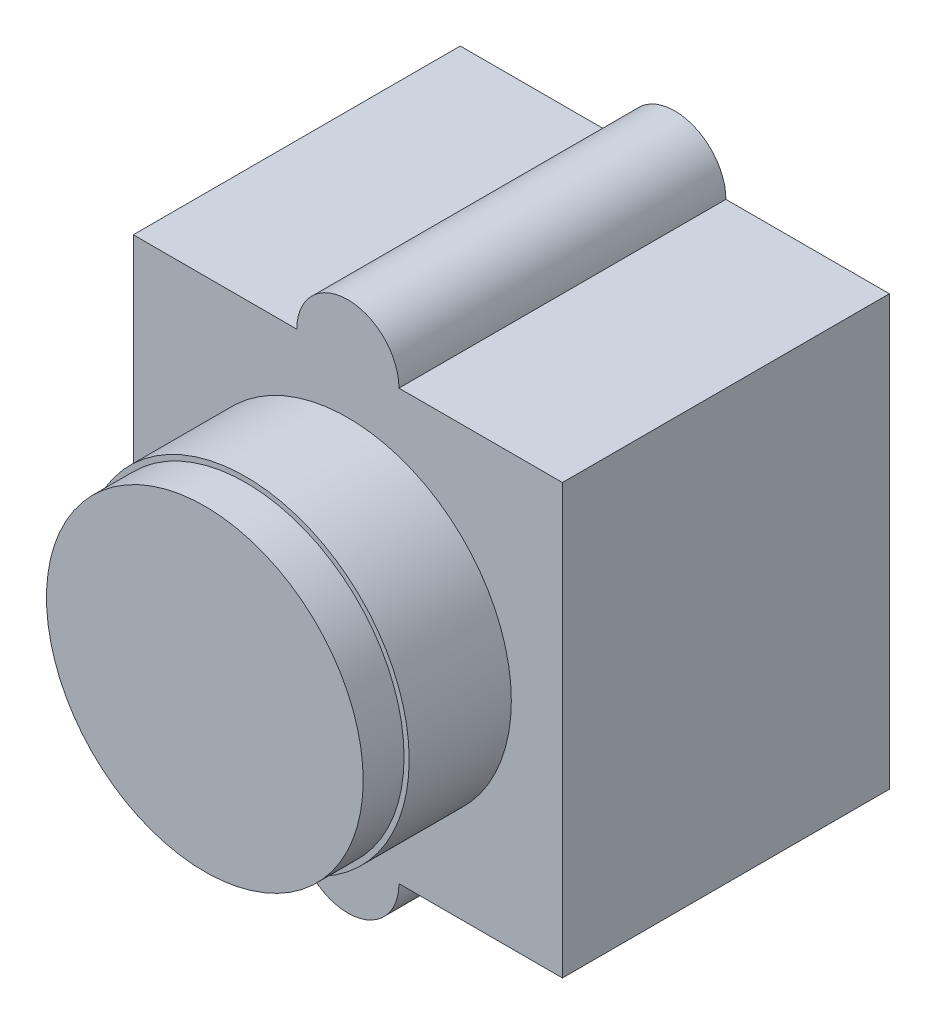
ISO-10303-21;
HEADER;
FILE_DESCRIPTION(('STEP AP214'),'2;1');
FILE_NAME('part.step','',(''),(''),'','','');
FILE_SCHEMA(('AUTOMOTIVE_DESIGN { 1 0 10303 214 1 1 1 1 }'));
ENDSEC;
DATA;
#1=APPLICATION_CONTEXT('core data for automotive mechanical design processes');
#2=APPLICATION_PROTOCOL_DEFINITION('international standard','automotive_design',2000,#1);
#3=PRODUCT_CONTEXT('',#1,'mechanical');
#4=PRODUCT('Part','Part','',(#3));
#5=PRODUCT_RELATED_PRODUCT_CATEGORY('part','',(#4));
#6=PRODUCT_DEFINITION_FORMATION('','',#4);
#7=PRODUCT_DEFINITION_CONTEXT('part definition',#1,'design');
#8=PRODUCT_DEFINITION('design','',#6,#7);
#9=PRODUCT_DEFINITION_SHAPE('','',#8);
#10=(LENGTH_UNIT() NAMED_UNIT(*) SI_UNIT(.MILLI.,.METRE.));
#11=(NAMED_UNIT(*) PLANE_ANGLE_UNIT() SI_UNIT($,.RADIAN.));
#12=(NAMED_UNIT(*) SI_UNIT($,.STERADIAN.) SOLID_ANGLE_UNIT());
#13=UNCERTAINTY_MEASURE_WITH_UNIT(LENGTH_MEASURE(1.E-05),#10,'distance_accuracy_value','');
#14=(GEOMETRIC_REPRESENTATION_CONTEXT(3) GLOBAL_UNCERTAINTY_ASSIGNED_CONTEXT((#13)) GLOBAL_UNIT_ASSIGNED_CONTEXT((#10,
#11,#12)) REPRESENTATION_CONTEXT('',''));
#15=CARTESIAN_POINT('',(0.,0.,0.));
#16=DIRECTION('',(0.,0.,1.));
#17=DIRECTION('',(1.,0.,0.));
#18=AXIS2_PLACEMENT_3D('',#15,#16,#17);
#19=CARTESIAN_POINT('',(0.,0.,21.));
#20=DIRECTION('',(0.,0.,1.));
#21=DIRECTION('',(1.,0.,0.));
#22=AXIS2_PLACEMENT_3D('',#19,#20,#21);
#23=PLANE('',#22);
#24=CARTESIAN_POINT('',(0.,0.,21.));
#25=DIRECTION('',(0.,0.,1.));
#26=DIRECTION('',(1.,0.,0.));
#27=AXIS2_PLACEMENT_3D('',#24,#25,#26);
#28=CIRCLE('',#27,8.);
#29=CARTESIAN_POINT('',(8.,0.,21.));
#30=VERTEX_POINT('',#29);
#31=EDGE_CURVE('E133',#30,#30,#28,.T.);
#32=ORIENTED_EDGE('',*,*,#31,.T.);
#33=EDGE_LOOP('',(#32));
#34=FACE_BOUND('',#33,.T.);
#35=CARTESIAN_POINT('',(0.,0.,21.));
#36=DIRECTION('',(0.,0.,1.));
#37=DIRECTION('',(1.,0.,0.));
#38=AXIS2_PLACEMENT_3D('',#35,#36,#37);
#39=CIRCLE('',#38,7.75);
#40=CARTESIAN_POINT('',(7.75,0.,21.));
#41=VERTEX_POINT('',#40);
#42=EDGE_CURVE('E183',#41,#41,#39,.T.);
#43=ORIENTED_EDGE('',*,*,#42,.F.);
#44=EDGE_LOOP('',(#43));
#45=FACE_BOUND('',#44,.T.);
#46=ADVANCED_FACE('F31',(#34,#45),#23,.T.);
#47=CARTESIAN_POINT('',(0.,-10.5,16.));
#48=DIRECTION('',(0.,0.,1.));
#49=DIRECTION('',(1.,0.,0.));
#50=AXIS2_PLACEMENT_3D('',#47,#48,#49);
#51=PLANE('',#50);
#52=DIRECTION('',(0.,-1.,0.));
#53=VECTOR('',#52,1.);
#54=CARTESIAN_POINT('',(-10.5,10.5,16.));
#55=LINE('',#54,#53);
#56=CARTESIAN_POINT('',(-10.5,10.5,16.));
#57=VERTEX_POINT('',#56);
#58=CARTESIAN_POINT('',(-10.5,-10.5,16.));
#59=VERTEX_POINT('',#58);
#60=EDGE_CURVE('E144',#57,#59,#55,.T.);
#61=ORIENTED_EDGE('',*,*,#60,.T.);
#62=DIRECTION('',(1.,0.,0.));
#63=VECTOR('',#62,1.);
#64=CARTESIAN_POINT('',(-10.5,-10.5,16.));
#65=LINE('',#64,#63);
#66=CARTESIAN_POINT('',(-2.49999999999999,-10.5,16.));
#67=VERTEX_POINT('',#66);
#68=EDGE_CURVE('E91',#59,#67,#65,.T.);
#69=ORIENTED_EDGE('',*,*,#68,.T.);
#70=CARTESIAN_POINT('',(0.,-10.5,16.));
#71=DIRECTION('',(0.,0.,1.));
#72=DIRECTION('',(1.,0.,0.));
#73=AXIS2_PLACEMENT_3D('',#70,#71,#72);
#74=CIRCLE('',#73,2.5);
#75=CARTESIAN_POINT('',(2.5,-10.5,16.));
#76=VERTEX_POINT('',#75);
#77=EDGE_CURVE('E159',#67,#76,#74,.T.);
#78=ORIENTED_EDGE('',*,*,#77,.T.);
#79=DIRECTION('',(1.,0.,0.));
#80=VECTOR('',#79,1.);
#81=CARTESIAN_POINT('',(2.5,-10.5,16.));
#82=LINE('',#81,#80);
#83=CARTESIAN_POINT('',(10.5,-10.5,16.));
#84=VERTEX_POINT('',#83);
#85=EDGE_CURVE('E171',#76,#84,#82,.T.);
#86=ORIENTED_EDGE('',*,*,#85,.T.);
#87=DIRECTION('',(0.,1.,0.));
#88=VECTOR('',#87,1.);
#89=CARTESIAN_POINT('',(10.5,10.5,16.));
#90=LINE('',#89,#88);
#91=CARTESIAN_POINT('',(10.5,10.5,16.));
#92=VERTEX_POINT('',#91);
#93=EDGE_CURVE('E111',#84,#92,#90,.T.);
#94=ORIENTED_EDGE('',*,*,#93,.T.);
#95=DIRECTION('',(-1.,0.,0.));
#96=VECTOR('',#95,1.);
#97=CARTESIAN_POINT('',(2.5,10.5,16.));
#98=LINE('',#97,#96);
#99=CARTESIAN_POINT('',(2.5,10.5,16.));
#100=VERTEX_POINT('',#99);
#101=EDGE_CURVE('E104',#92,#100,#98,.T.);
#102=ORIENTED_EDGE('',*,*,#101,.T.);
#103=CARTESIAN_POINT('',(0.,10.5,16.));
#104=DIRECTION('',(0.,0.,1.));
#105=DIRECTION('',(1.,0.,0.));
#106=AXIS2_PLACEMENT_3D('',#103,#104,#105);
#107=CIRCLE('',#106,2.5);
#108=CARTESIAN_POINT('',(-2.5,10.5,16.));
#109=VERTEX_POINT('',#108);
#110=EDGE_CURVE('E109',#100,#109,#107,.T.);
#111=ORIENTED_EDGE('',*,*,#110,.T.);
#112=DIRECTION('',(-1.,0.,0.));
#113=VECTOR('',#112,1.);
#114=CARTESIAN_POINT('',(-10.5,10.5,16.));
#115=LINE('',#114,#113);
#116=EDGE_CURVE('E48',#109,#57,#115,.T.);
#117=ORIENTED_EDGE('',*,*,#116,.T.);
#118=EDGE_LOOP('',(#61,#69,#78,#86,#94,#102,#111,#117));
#119=FACE_BOUND('',#118,.T.);
#120=CARTESIAN_POINT('',(0.,0.,16.));
#121=DIRECTION('',(0.,0.,1.));
#122=DIRECTION('',(1.,0.,0.));
#123=AXIS2_PLACEMENT_3D('',#120,#121,#122);
#124=CIRCLE('',#123,8.);
#125=CARTESIAN_POINT('',(8.,0.,16.));
#126=VERTEX_POINT('',#125);
#127=EDGE_CURVE('E177',#126,#126,#124,.T.);
#128=ORIENTED_EDGE('',*,*,#127,.F.);
#129=EDGE_LOOP('',(#128));
#130=FACE_BOUND('',#129,.T.);
#131=ADVANCED_FACE('F106',(#119,#130),#51,.T.);
#132=CARTESIAN_POINT('',(-10.5,10.5,16.));
#133=DIRECTION('',(1.,0.,0.));
#134=DIRECTION('',(0.,0.,-1.));
#135=AXIS2_PLACEMENT_3D('',#132,#133,#134);
#136=PLANE('',#135);
#137=DIRECTION('',(0.,-1.,0.));
#138=VECTOR('',#137,1.);
#139=CARTESIAN_POINT('',(-10.5,10.5,0.));
#140=LINE('',#139,#138);
#141=CARTESIAN_POINT('',(-10.5,10.5,0.));
#142=VERTEX_POINT('',#141);
#143=CARTESIAN_POINT('',(-10.5,-10.5,0.));
#144=VERTEX_POINT('',#143);
#145=EDGE_CURVE('E129',#142,#144,#140,.T.);
#146=ORIENTED_EDGE('',*,*,#145,.T.);
#147=DIRECTION('',(0.,0.,-1.));
#148=VECTOR('',#147,1.);
#149=CARTESIAN_POINT('',(-10.5,-10.5,16.));
#150=LINE('',#149,#148);
#151=EDGE_CURVE('E11',#59,#144,#150,.T.);
#152=ORIENTED_EDGE('',*,*,#151,.F.);
#153=ORIENTED_EDGE('',*,*,#60,.F.);
#154=DIRECTION('',(0.,0.,-1.));
#155=VECTOR('',#154,1.);
#156=CARTESIAN_POINT('',(-10.5,10.5,16.));
#157=LINE('',#156,#155);
#158=EDGE_CURVE('E125',#57,#142,#157,.T.);
#159=ORIENTED_EDGE('',*,*,#158,.T.);
#160=EDGE_LOOP('',(#146,#152,#153,#159));
#161=FACE_BOUND('',#160,.T.);
#162=ADVANCED_FACE('F33',(#161),#136,.F.);
#163=CARTESIAN_POINT('',(-10.5,-10.5,16.));
#164=DIRECTION('',(0.,1.,0.));
#165=DIRECTION('',(-1.,0.,0.));
#166=AXIS2_PLACEMENT_3D('',#163,#164,#165);
#167=PLANE('',#166);
#168=DIRECTION('',(1.,0.,0.));
#169=VECTOR('',#168,1.);
#170=CARTESIAN_POINT('',(-10.5,-10.5,0.));
#171=LINE('',#170,#169);
#172=CARTESIAN_POINT('',(-2.49999999999999,-10.5,0.));
#173=VERTEX_POINT('',#172);
#174=EDGE_CURVE('E132',#144,#173,#171,.T.);
#175=ORIENTED_EDGE('',*,*,#174,.T.);
#176=DIRECTION('',(0.,0.,-1.));
#177=VECTOR('',#176,1.);
#178=CARTESIAN_POINT('',(-2.49999999999999,-10.5,16.));
#179=LINE('',#178,#177);
#180=EDGE_CURVE('E40',#67,#173,#179,.T.);
#181=ORIENTED_EDGE('',*,*,#180,.F.);
#182=ORIENTED_EDGE('',*,*,#68,.F.);
#183=ORIENTED_EDGE('',*,*,#151,.T.);
#184=EDGE_LOOP('',(#175,#181,#182,#183));
#185=FACE_BOUND('',#184,.T.);
#186=ADVANCED_FACE('F224',(#185),#167,.F.);
#187=CARTESIAN_POINT('',(0.,-10.5,16.));
#188=DIRECTION('',(0.,0.,-1.));
#189=DIRECTION('',(-1.,0.,0.));
#190=AXIS2_PLACEMENT_3D('',#187,#188,#189);
#191=CYLINDRICAL_SURFACE('',#190,2.5);
#192=CARTESIAN_POINT('',(0.,-10.5,0.));
#193=DIRECTION('',(0.,0.,1.));
#194=DIRECTION('',(1.,0.,0.));
#195=AXIS2_PLACEMENT_3D('',#192,#193,#194);
#196=CIRCLE('',#195,2.5);
#197=CARTESIAN_POINT('',(2.5,-10.5,0.));
#198=VERTEX_POINT('',#197);
#199=EDGE_CURVE('E135',#173,#198,#196,.T.);
#200=ORIENTED_EDGE('',*,*,#199,.T.);
#201=DIRECTION('',(0.,0.,-1.));
#202=VECTOR('',#201,1.);
#203=CARTESIAN_POINT('',(2.5,-10.5,16.));
#204=LINE('',#203,#202);
#205=EDGE_CURVE('E151',#76,#198,#204,.T.);
#206=ORIENTED_EDGE('',*,*,#205,.F.);
#207=ORIENTED_EDGE('',*,*,#77,.F.);
#208=ORIENTED_EDGE('',*,*,#180,.T.);
#209=EDGE_LOOP('',(#200,#206,#207,#208));
#210=FACE_BOUND('',#209,.T.);
#211=ADVANCED_FACE('F157',(#210),#191,.T.);
#212=CARTESIAN_POINT('',(2.5,-10.5,16.));
#213=DIRECTION('',(0.,1.,0.));
#214=DIRECTION('',(-1.,0.,0.));
#215=AXIS2_PLACEMENT_3D('',#212,#213,#214);
#216=PLANE('',#215);
#217=DIRECTION('',(1.,0.,0.));
#218=VECTOR('',#217,1.);
#219=CARTESIAN_POINT('',(2.5,-10.5,0.));
#220=LINE('',#219,#218);
#221=CARTESIAN_POINT('',(10.5,-10.5,0.));
#222=VERTEX_POINT('',#221);
#223=EDGE_CURVE('E137',#198,#222,#220,.T.);
#224=ORIENTED_EDGE('',*,*,#223,.T.);
#225=DIRECTION('',(0.,0.,-1.));
#226=VECTOR('',#225,1.);
#227=CARTESIAN_POINT('',(10.5,-10.5,16.));
#228=LINE('',#227,#226);
#229=EDGE_CURVE('E148',#84,#222,#228,.T.);
#230=ORIENTED_EDGE('',*,*,#229,.F.);
#231=ORIENTED_EDGE('',*,*,#85,.F.);
#232=ORIENTED_EDGE('',*,*,#205,.T.);
#233=EDGE_LOOP('',(#224,#230,#231,#232));
#234=FACE_BOUND('',#233,.T.);
#235=ADVANCED_FACE('F167',(#234),#216,.F.);
#236=CARTESIAN_POINT('',(10.5,10.5,16.));
#237=DIRECTION('',(-1.,0.,0.));
#238=DIRECTION('',(0.,-1.,0.));
#239=AXIS2_PLACEMENT_3D('',#236,#237,#238);
#240=PLANE('',#239);
#241=DIRECTION('',(0.,1.,0.));
#242=VECTOR('',#241,1.);
#243=CARTESIAN_POINT('',(10.5,10.5,0.));
#244=LINE('',#243,#242);
#245=CARTESIAN_POINT('',(10.5,10.5,0.));
#246=VERTEX_POINT('',#245);
#247=EDGE_CURVE('E139',#222,#246,#244,.T.);
#248=ORIENTED_EDGE('',*,*,#247,.T.);
#249=DIRECTION('',(0.,0.,-1.));
#250=VECTOR('',#249,1.);
#251=CARTESIAN_POINT('',(10.5,10.5,16.));
#252=LINE('',#251,#250);
#253=EDGE_CURVE('E120',#92,#246,#252,.T.);
#254=ORIENTED_EDGE('',*,*,#253,.F.);
#255=ORIENTED_EDGE('',*,*,#93,.F.);
#256=ORIENTED_EDGE('',*,*,#229,.T.);
#257=EDGE_LOOP('',(#248,#254,#255,#256));
#258=FACE_BOUND('',#257,.T.);
#259=ADVANCED_FACE('F170',(#258),#240,.F.);
#260=CARTESIAN_POINT('',(2.5,10.5,16.));
#261=DIRECTION('',(0.,-1.,0.));
#262=DIRECTION('',(1.,0.,0.));
#263=AXIS2_PLACEMENT_3D('',#260,#261,#262);
#264=PLANE('',#263);
#265=DIRECTION('',(-1.,0.,0.));
#266=VECTOR('',#265,1.);
#267=CARTESIAN_POINT('',(2.5,10.5,0.));
#268=LINE('',#267,#266);
#269=CARTESIAN_POINT('',(2.5,10.5,0.));
#270=VERTEX_POINT('',#269);
#271=EDGE_CURVE('E119',#246,#270,#268,.T.);
#272=ORIENTED_EDGE('',*,*,#271,.T.);
#273=DIRECTION('',(0.,0.,-1.));
#274=VECTOR('',#273,1.);
#275=CARTESIAN_POINT('',(2.5,10.5,16.));
#276=LINE('',#275,#274);
#277=EDGE_CURVE('E116',#100,#270,#276,.T.);
#278=ORIENTED_EDGE('',*,*,#277,.F.);
#279=ORIENTED_EDGE('',*,*,#101,.F.);
#280=ORIENTED_EDGE('',*,*,#253,.T.);
#281=EDGE_LOOP('',(#272,#278,#279,#280));
#282=FACE_BOUND('',#281,.T.);
#283=ADVANCED_FACE('F117',(#282),#264,.F.);
#284=CARTESIAN_POINT('',(0.,10.5,16.));
#285=DIRECTION('',(0.,0.,-1.));
#286=DIRECTION('',(-1.,0.,0.));
#287=AXIS2_PLACEMENT_3D('',#284,#285,#286);
#288=CYLINDRICAL_SURFACE('',#287,2.5);
#289=CARTESIAN_POINT('',(0.,10.5,0.));
#290=DIRECTION('',(0.,0.,1.));
#291=DIRECTION('',(1.,0.,0.));
#292=AXIS2_PLACEMENT_3D('',#289,#290,#291);
#293=CIRCLE('',#292,2.5);
#294=CARTESIAN_POINT('',(-2.5,10.5,0.));
#295=VERTEX_POINT('',#294);
#296=EDGE_CURVE('E77',#270,#295,#293,.T.);
#297=ORIENTED_EDGE('',*,*,#296,.T.);
#298=DIRECTION('',(0.,0.,-1.));
#299=VECTOR('',#298,1.);
#300=CARTESIAN_POINT('',(-2.5,10.5,16.));
#301=LINE('',#300,#299);
#302=EDGE_CURVE('E121',#109,#295,#301,.T.);
#303=ORIENTED_EDGE('',*,*,#302,.F.);
#304=ORIENTED_EDGE('',*,*,#110,.F.);
#305=ORIENTED_EDGE('',*,*,#277,.T.);
#306=EDGE_LOOP('',(#297,#303,#304,#305));
#307=FACE_BOUND('',#306,.T.);
#308=ADVANCED_FACE('F123',(#307),#288,.T.);
#309=CARTESIAN_POINT('',(-10.5,10.5,16.));
#310=DIRECTION('',(0.,-1.,0.));
#311=DIRECTION('',(1.,0.,0.));
#312=AXIS2_PLACEMENT_3D('',#309,#310,#311);
#313=PLANE('',#312);
#314=DIRECTION('',(-1.,0.,0.));
#315=VECTOR('',#314,1.);
#316=CARTESIAN_POINT('',(-10.5,10.5,0.));
#317=LINE('',#316,#315);
#318=EDGE_CURVE('E83',#295,#142,#317,.T.);
#319=ORIENTED_EDGE('',*,*,#318,.T.);
#320=ORIENTED_EDGE('',*,*,#158,.F.);
#321=ORIENTED_EDGE('',*,*,#116,.F.);
#322=ORIENTED_EDGE('',*,*,#302,.T.);
#323=EDGE_LOOP('',(#319,#320,#321,#322));
#324=FACE_BOUND('',#323,.T.);
#325=ADVANCED_FACE('F212',(#324),#313,.F.);
#326=CARTESIAN_POINT('',(0.,-10.5,0.));
#327=DIRECTION('',(0.,0.,1.));
#328=DIRECTION('',(1.,0.,0.));
#329=AXIS2_PLACEMENT_3D('',#326,#327,#328);
#330=PLANE('',#329);
#331=ORIENTED_EDGE('',*,*,#145,.F.);
#332=ORIENTED_EDGE('',*,*,#318,.F.);
#333=ORIENTED_EDGE('',*,*,#296,.F.);
#334=ORIENTED_EDGE('',*,*,#271,.F.);
#335=ORIENTED_EDGE('',*,*,#247,.F.);
#336=ORIENTED_EDGE('',*,*,#223,.F.);
#337=ORIENTED_EDGE('',*,*,#199,.F.);
#338=ORIENTED_EDGE('',*,*,#174,.F.);
#339=EDGE_LOOP('',(#331,#332,#333,#334,#335,#336,#337,#338));
#340=FACE_BOUND('',#339,.T.);
#341=ADVANCED_FACE('F163',(#340),#330,.F.);
#342=CARTESIAN_POINT('',(0.,0.,21.));
#343=DIRECTION('',(0.,0.,-1.));
#344=DIRECTION('',(-1.,0.,0.));
#345=AXIS2_PLACEMENT_3D('',#342,#343,#344);
#346=CYLINDRICAL_SURFACE('',#345,8.);
#347=ORIENTED_EDGE('',*,*,#31,.F.);
#348=EDGE_LOOP('',(#347));
#349=FACE_BOUND('',#348,.T.);
#350=ORIENTED_EDGE('',*,*,#127,.T.);
#351=EDGE_LOOP('',(#350));
#352=FACE_BOUND('',#351,.T.);
#353=ADVANCED_FACE('F194',(#349,#352),#346,.T.);
#354=CARTESIAN_POINT('',(0.,0.,23.));
#355=DIRECTION('',(0.,0.,-1.));
#356=DIRECTION('',(-1.,0.,0.));
#357=AXIS2_PLACEMENT_3D('',#354,#355,#356);
#358=CYLINDRICAL_SURFACE('',#357,7.75);
#359=CARTESIAN_POINT('',(0.,0.,23.));
#360=DIRECTION('',(0.,0.,1.));
#361=DIRECTION('',(1.,0.,0.));
#362=AXIS2_PLACEMENT_3D('',#359,#360,#361);
#363=CIRCLE('',#362,7.75);
#364=CARTESIAN_POINT('',(7.75,0.,23.));
#365=VERTEX_POINT('',#364);
#366=EDGE_CURVE('E180',#365,#365,#363,.T.);
#367=ORIENTED_EDGE('',*,*,#366,.F.);
#368=EDGE_LOOP('',(#367));
#369=FACE_BOUND('',#368,.T.);
#370=ORIENTED_EDGE('',*,*,#42,.T.);
#371=EDGE_LOOP('',(#370));
#372=FACE_BOUND('',#371,.T.);
#373=ADVANCED_FACE('F191',(#369,#372),#358,.T.);
#374=CARTESIAN_POINT('',(0.,0.,23.));
#375=DIRECTION('',(0.,0.,1.));
#376=DIRECTION('',(1.,0.,0.));
#377=AXIS2_PLACEMENT_3D('',#374,#375,#376);
#378=PLANE('',#377);
#379=ORIENTED_EDGE('',*,*,#366,.T.);
#380=EDGE_LOOP('',(#379));
#381=FACE_BOUND('',#380,.T.);
#382=ADVANCED_FACE('F189',(#381),#378,.T.);
#383=CLOSED_SHELL('',(#46,#131,#162,#186,#211,#235,#259,#283,#308,#325,#341,#353,#373,#382));
#384=MANIFOLD_SOLID_BREP('B2',#383);
#385=ADVANCED_BREP_SHAPE_REPRESENTATION('',(#18,#384),#14);
#386=SHAPE_DEFINITION_REPRESENTATION(#9,#385);
ENDSEC;
END-ISO-10303-21;
